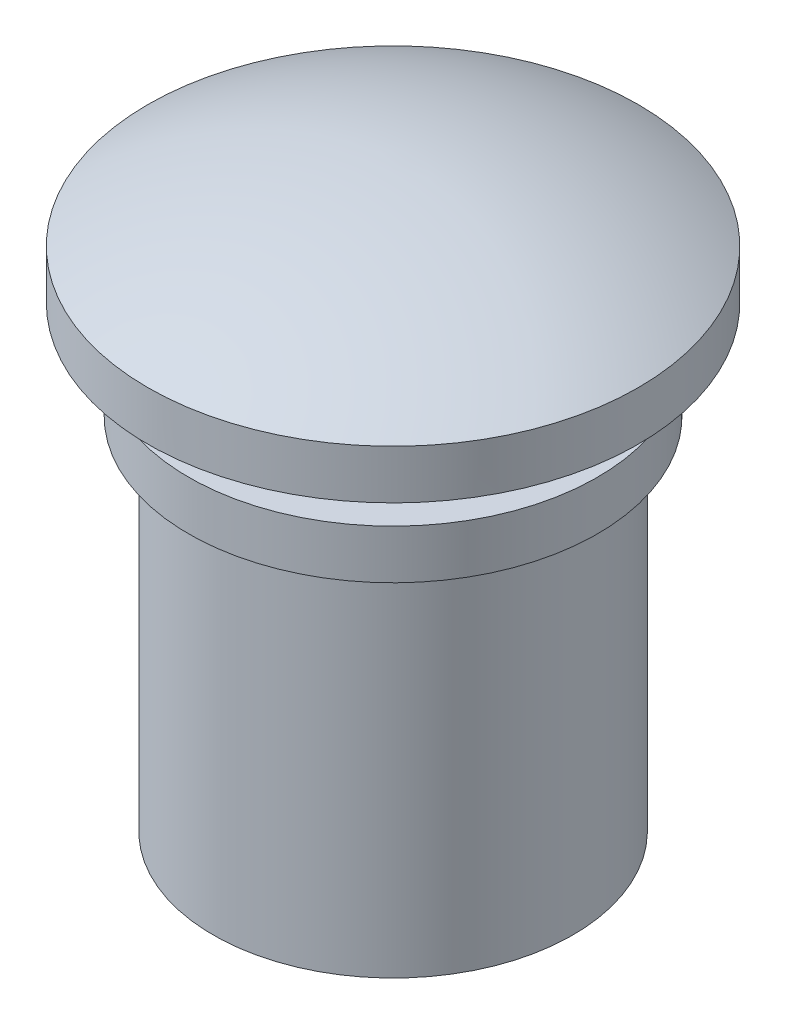
ISO-10303-21;
HEADER;
FILE_DESCRIPTION(('STEP AP214'),'2;1');
FILE_NAME('part.step','',(''),(''),'','','');
FILE_SCHEMA(('AUTOMOTIVE_DESIGN { 1 0 10303 214 1 1 1 1 }'));
ENDSEC;
DATA;
#1=APPLICATION_CONTEXT('core data for automotive mechanical design processes');
#2=APPLICATION_PROTOCOL_DEFINITION('international standard','automotive_design',2000,#1);
#3=PRODUCT_CONTEXT('',#1,'mechanical');
#4=PRODUCT('Part','Part','',(#3));
#5=PRODUCT_RELATED_PRODUCT_CATEGORY('part','',(#4));
#6=PRODUCT_DEFINITION_FORMATION('','',#4);
#7=PRODUCT_DEFINITION_CONTEXT('part definition',#1,'design');
#8=PRODUCT_DEFINITION('design','',#6,#7);
#9=PRODUCT_DEFINITION_SHAPE('','',#8);
#10=(LENGTH_UNIT() NAMED_UNIT(*) SI_UNIT(.MILLI.,.METRE.));
#11=(NAMED_UNIT(*) PLANE_ANGLE_UNIT() SI_UNIT($,.RADIAN.));
#12=(NAMED_UNIT(*) SI_UNIT($,.STERADIAN.) SOLID_ANGLE_UNIT());
#13=UNCERTAINTY_MEASURE_WITH_UNIT(LENGTH_MEASURE(1.E-05),#10,'distance_accuracy_value','');
#14=(GEOMETRIC_REPRESENTATION_CONTEXT(3) GLOBAL_UNCERTAINTY_ASSIGNED_CONTEXT((#13)) GLOBAL_UNIT_ASSIGNED_CONTEXT((#10,
#11,#12)) REPRESENTATION_CONTEXT('',''));
#15=CARTESIAN_POINT('',(0.,0.,0.));
#16=DIRECTION('',(0.,0.,1.));
#17=DIRECTION('',(1.,0.,0.));
#18=AXIS2_PLACEMENT_3D('',#15,#16,#17);
#19=CARTESIAN_POINT('',(0.,-17.125,0.));
#20=DIRECTION('',(0.,-1.,0.));
#21=DIRECTION('',(0.,0.,1.));
#22=AXIS2_PLACEMENT_3D('',#19,#20,#21);
#23=SPHERICAL_SURFACE('',#22,30.125);
#24=CARTESIAN_POINT('',(0.,9.00000000000001,0.));
#25=DIRECTION('',(0.,-1.,0.));
#26=DIRECTION('',(0.,0.,-1.));
#27=AXIS2_PLACEMENT_3D('',#24,#25,#26);
#28=CIRCLE('',#27,15.);
#29=CARTESIAN_POINT('',(0.,9.00000000000001,-15.));
#30=VERTEX_POINT('',#29);
#31=EDGE_CURVE('E10',#30,#30,#28,.T.);
#32=ORIENTED_EDGE('',*,*,#31,.F.);
#33=EDGE_LOOP('',(#32));
#34=FACE_BOUND('',#33,.T.);
#35=ADVANCED_FACE('F31',(#34),#23,.T.);
#36=CARTESIAN_POINT('',(0.,0.,0.));
#37=DIRECTION('',(0.,-1.,0.));
#38=DIRECTION('',(0.,0.,-1.));
#39=AXIS2_PLACEMENT_3D('',#36,#37,#38);
#40=CYLINDRICAL_SURFACE('',#39,15.);
#41=ORIENTED_EDGE('',*,*,#31,.T.);
#42=EDGE_LOOP('',(#41));
#43=FACE_BOUND('',#42,.T.);
#44=CARTESIAN_POINT('',(0.,6.,0.));
#45=DIRECTION('',(0.,-1.,0.));
#46=DIRECTION('',(0.,0.,-1.));
#47=AXIS2_PLACEMENT_3D('',#44,#45,#46);
#48=CIRCLE('',#47,15.);
#49=CARTESIAN_POINT('',(0.,6.,-15.));
#50=VERTEX_POINT('',#49);
#51=EDGE_CURVE('E37',#50,#50,#48,.T.);
#52=ORIENTED_EDGE('',*,*,#51,.F.);
#53=EDGE_LOOP('',(#52));
#54=FACE_BOUND('',#53,.T.);
#55=ADVANCED_FACE('F79',(#43,#54),#40,.T.);
#56=CARTESIAN_POINT('',(0.,6.,-8.));
#57=DIRECTION('',(0.,-1.,0.));
#58=DIRECTION('',(0.,0.,-1.));
#59=AXIS2_PLACEMENT_3D('',#56,#57,#58);
#60=PLANE('',#59);
#61=ORIENTED_EDGE('',*,*,#51,.T.);
#62=EDGE_LOOP('',(#61));
#63=FACE_BOUND('',#62,.T.);
#64=CARTESIAN_POINT('',(0.,6.,0.));
#65=DIRECTION('',(0.,-1.,0.));
#66=DIRECTION('',(0.,0.,-1.));
#67=AXIS2_PLACEMENT_3D('',#64,#65,#66);
#68=CIRCLE('',#67,8.);
#69=CARTESIAN_POINT('',(0.,6.,-8.));
#70=VERTEX_POINT('',#69);
#71=EDGE_CURVE('E41',#70,#70,#68,.T.);
#72=ORIENTED_EDGE('',*,*,#71,.F.);
#73=EDGE_LOOP('',(#72));
#74=FACE_BOUND('',#73,.T.);
#75=ADVANCED_FACE('F84',(#63,#74),#60,.T.);
#76=CARTESIAN_POINT('',(0.,0.,0.));
#77=DIRECTION('',(0.,-1.,0.));
#78=DIRECTION('',(0.,0.,-1.));
#79=AXIS2_PLACEMENT_3D('',#76,#77,#78);
#80=CYLINDRICAL_SURFACE('',#79,8.);
#81=ORIENTED_EDGE('',*,*,#71,.T.);
#82=EDGE_LOOP('',(#81));
#83=FACE_BOUND('',#82,.T.);
#84=CARTESIAN_POINT('',(0.,3.,0.));
#85=DIRECTION('',(0.,-1.,0.));
#86=DIRECTION('',(0.,0.,-1.));
#87=AXIS2_PLACEMENT_3D('',#84,#85,#86);
#88=CIRCLE('',#87,8.);
#89=CARTESIAN_POINT('',(0.,3.,-8.));
#90=VERTEX_POINT('',#89);
#91=EDGE_CURVE('E45',#90,#90,#88,.T.);
#92=ORIENTED_EDGE('',*,*,#91,.F.);
#93=EDGE_LOOP('',(#92));
#94=FACE_BOUND('',#93,.T.);
#95=ADVANCED_FACE('F88',(#83,#94),#80,.T.);
#96=CARTESIAN_POINT('',(0.,3.,-12.5));
#97=DIRECTION('',(0.,1.,0.));
#98=DIRECTION('',(0.,0.,1.));
#99=AXIS2_PLACEMENT_3D('',#96,#97,#98);
#100=PLANE('',#99);
#101=ORIENTED_EDGE('',*,*,#91,.T.);
#102=EDGE_LOOP('',(#101));
#103=FACE_BOUND('',#102,.T.);
#104=CARTESIAN_POINT('',(0.,3.,0.));
#105=DIRECTION('',(0.,-1.,0.));
#106=DIRECTION('',(0.,0.,-1.));
#107=AXIS2_PLACEMENT_3D('',#104,#105,#106);
#108=CIRCLE('',#107,12.5);
#109=CARTESIAN_POINT('',(0.,3.,-12.5));
#110=VERTEX_POINT('',#109);
#111=EDGE_CURVE('E50',#110,#110,#108,.T.);
#112=ORIENTED_EDGE('',*,*,#111,.F.);
#113=EDGE_LOOP('',(#112));
#114=FACE_BOUND('',#113,.T.);
#115=ADVANCED_FACE('F94',(#103,#114),#100,.T.);
#116=CARTESIAN_POINT('',(0.,0.,0.));
#117=DIRECTION('',(0.,-1.,0.));
#118=DIRECTION('',(0.,0.,-1.));
#119=AXIS2_PLACEMENT_3D('',#116,#117,#118);
#120=CYLINDRICAL_SURFACE('',#119,12.5);
#121=ORIENTED_EDGE('',*,*,#111,.T.);
#122=EDGE_LOOP('',(#121));
#123=FACE_BOUND('',#122,.T.);
#124=CARTESIAN_POINT('',(0.,0.,0.));
#125=DIRECTION('',(0.,-1.,0.));
#126=DIRECTION('',(0.,0.,-1.));
#127=AXIS2_PLACEMENT_3D('',#124,#125,#126);
#128=CIRCLE('',#127,12.5);
#129=CARTESIAN_POINT('',(0.,0.,-12.5));
#130=VERTEX_POINT('',#129);
#131=EDGE_CURVE('E53',#130,#130,#128,.T.);
#132=ORIENTED_EDGE('',*,*,#131,.F.);
#133=EDGE_LOOP('',(#132));
#134=FACE_BOUND('',#133,.T.);
#135=ADVANCED_FACE('F75',(#123,#134),#120,.T.);
#136=CARTESIAN_POINT('',(0.,0.,-11.));
#137=DIRECTION('',(0.,-1.,0.));
#138=DIRECTION('',(0.,0.,-1.));
#139=AXIS2_PLACEMENT_3D('',#136,#137,#138);
#140=PLANE('',#139);
#141=ORIENTED_EDGE('',*,*,#131,.T.);
#142=EDGE_LOOP('',(#141));
#143=FACE_BOUND('',#142,.T.);
#144=CARTESIAN_POINT('',(0.,0.,0.));
#145=DIRECTION('',(0.,-1.,0.));
#146=DIRECTION('',(0.,0.,-1.));
#147=AXIS2_PLACEMENT_3D('',#144,#145,#146);
#148=CIRCLE('',#147,11.);
#149=CARTESIAN_POINT('',(0.,0.,-11.));
#150=VERTEX_POINT('',#149);
#151=EDGE_CURVE('E56',#150,#150,#148,.T.);
#152=ORIENTED_EDGE('',*,*,#151,.F.);
#153=EDGE_LOOP('',(#152));
#154=FACE_BOUND('',#153,.T.);
#155=ADVANCED_FACE('F67',(#143,#154),#140,.T.);
#156=CARTESIAN_POINT('',(0.,0.,0.));
#157=DIRECTION('',(0.,-1.,0.));
#158=DIRECTION('',(0.,0.,-1.));
#159=AXIS2_PLACEMENT_3D('',#156,#157,#158);
#160=CYLINDRICAL_SURFACE('',#159,11.);
#161=ORIENTED_EDGE('',*,*,#151,.T.);
#162=EDGE_LOOP('',(#161));
#163=FACE_BOUND('',#162,.T.);
#164=CARTESIAN_POINT('',(0.,-22.,0.));
#165=DIRECTION('',(0.,-1.,0.));
#166=DIRECTION('',(0.,0.,-1.));
#167=AXIS2_PLACEMENT_3D('',#164,#165,#166);
#168=CIRCLE('',#167,11.);
#169=CARTESIAN_POINT('',(0.,-22.,-11.));
#170=VERTEX_POINT('',#169);
#171=EDGE_CURVE('E59',#170,#170,#168,.T.);
#172=ORIENTED_EDGE('',*,*,#171,.F.);
#173=EDGE_LOOP('',(#172));
#174=FACE_BOUND('',#173,.T.);
#175=ADVANCED_FACE('F65',(#163,#174),#160,.T.);
#176=CARTESIAN_POINT('',(0.,-22.,0.));
#177=DIRECTION('',(0.,-1.,0.));
#178=DIRECTION('',(0.,0.,-1.));
#179=AXIS2_PLACEMENT_3D('',#176,#177,#178);
#180=PLANE('',#179);
#181=ORIENTED_EDGE('',*,*,#171,.T.);
#182=EDGE_LOOP('',(#181));
#183=FACE_BOUND('',#182,.T.);
#184=ADVANCED_FACE('F63',(#183),#180,.T.);
#185=CLOSED_SHELL('',(#35,#55,#75,#95,#115,#135,#155,#175,#184));
#186=MANIFOLD_SOLID_BREP('B2',#185);
#187=ADVANCED_BREP_SHAPE_REPRESENTATION('',(#18,#186),#14);
#188=SHAPE_DEFINITION_REPRESENTATION(#9,#187);
ENDSEC;
END-ISO-10303-21;
